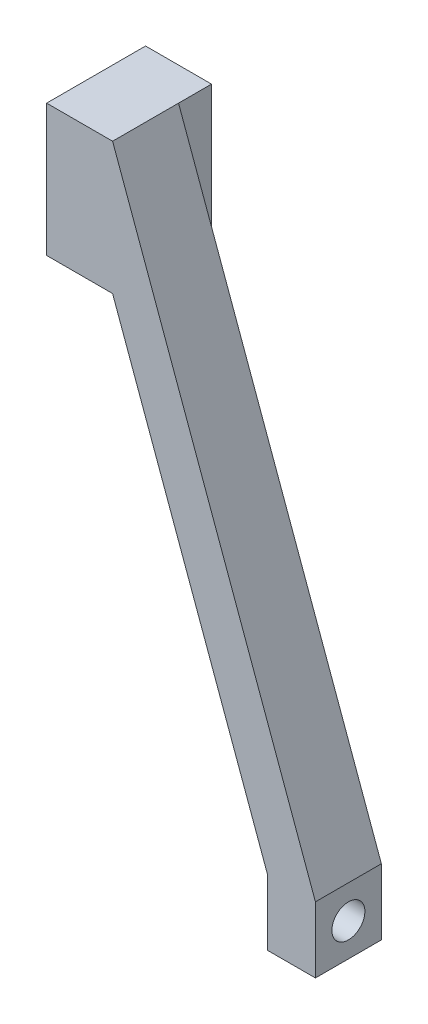
ISO-10303-21;
HEADER;
FILE_DESCRIPTION(('STEP AP214'),'2;1');
FILE_NAME('part.step','',(''),(''),'','','');
FILE_SCHEMA(('AUTOMOTIVE_DESIGN { 1 0 10303 214 1 1 1 1 }'));
ENDSEC;
DATA;
#1=APPLICATION_CONTEXT('core data for automotive mechanical design processes');
#2=APPLICATION_PROTOCOL_DEFINITION('international standard','automotive_design',2000,#1);
#3=PRODUCT_CONTEXT('',#1,'mechanical');
#4=PRODUCT('Part','Part','',(#3));
#5=PRODUCT_RELATED_PRODUCT_CATEGORY('part','',(#4));
#6=PRODUCT_DEFINITION_FORMATION('','',#4);
#7=PRODUCT_DEFINITION_CONTEXT('part definition',#1,'design');
#8=PRODUCT_DEFINITION('design','',#6,#7);
#9=PRODUCT_DEFINITION_SHAPE('','',#8);
#10=(LENGTH_UNIT() NAMED_UNIT(*) SI_UNIT(.MILLI.,.METRE.));
#11=(NAMED_UNIT(*) PLANE_ANGLE_UNIT() SI_UNIT($,.RADIAN.));
#12=(NAMED_UNIT(*) SI_UNIT($,.STERADIAN.) SOLID_ANGLE_UNIT());
#13=UNCERTAINTY_MEASURE_WITH_UNIT(LENGTH_MEASURE(1.E-05),#10,'distance_accuracy_value','');
#14=(GEOMETRIC_REPRESENTATION_CONTEXT(3) GLOBAL_UNCERTAINTY_ASSIGNED_CONTEXT((#13)) GLOBAL_UNIT_ASSIGNED_CONTEXT((#10,
#11,#12)) REPRESENTATION_CONTEXT('',''));
#15=CARTESIAN_POINT('',(0.,0.,0.));
#16=DIRECTION('',(0.,0.,1.));
#17=DIRECTION('',(1.,0.,0.));
#18=AXIS2_PLACEMENT_3D('',#15,#16,#17);
#19=CARTESIAN_POINT('',(42.5091621864025,0.,-12.7));
#20=DIRECTION('',(0.,0.,-1.));
#21=DIRECTION('',(-1.,0.,0.));
#22=AXIS2_PLACEMENT_3D('',#19,#20,#21);
#23=PLANE('',#22);
#24=DIRECTION('',(0.342020143325674,-0.939692620785907,0.));
#25=VECTOR('',#24,1.);
#26=CARTESIAN_POINT('',(12.7,0.,-12.7));
#27=LINE('',#26,#25);
#28=CARTESIAN_POINT('',(12.7,0.,-12.7));
#29=VERTEX_POINT('',#28);
#30=CARTESIAN_POINT('',(42.5091621864025,-81.9,-12.7));
#31=VERTEX_POINT('',#30);
#32=EDGE_CURVE('E130',#29,#31,#27,.T.);
#33=ORIENTED_EDGE('',*,*,#32,.F.);
#34=DIRECTION('',(0.,1.,0.));
#35=VECTOR('',#34,1.);
#36=CARTESIAN_POINT('',(12.7,0.,-12.7));
#37=LINE('',#36,#35);
#38=CARTESIAN_POINT('',(12.7,25.4,-12.7));
#39=VERTEX_POINT('',#38);
#40=EDGE_CURVE('E191',#29,#39,#37,.T.);
#41=ORIENTED_EDGE('',*,*,#40,.T.);
#42=DIRECTION('',(-0.342020143325674,0.939692620785907,0.));
#43=VECTOR('',#42,1.);
#44=CARTESIAN_POINT('',(51.7540061367641,-81.9,-12.7));
#45=LINE('',#44,#43);
#46=CARTESIAN_POINT('',(51.7540061367641,-81.9,-12.7));
#47=VERTEX_POINT('',#46);
#48=EDGE_CURVE('E125',#47,#39,#45,.T.);
#49=ORIENTED_EDGE('',*,*,#48,.F.);
#50=DIRECTION('',(0.,1.,0.));
#51=VECTOR('',#50,1.);
#52=CARTESIAN_POINT('',(51.7540061367641,-94.6,-12.7));
#53=LINE('',#52,#51);
#54=CARTESIAN_POINT('',(51.7540061367641,-94.6,-12.7));
#55=VERTEX_POINT('',#54);
#56=EDGE_CURVE('E109',#55,#47,#53,.T.);
#57=ORIENTED_EDGE('',*,*,#56,.F.);
#58=DIRECTION('',(1.,0.,0.));
#59=VECTOR('',#58,1.);
#60=CARTESIAN_POINT('',(42.5091621864025,-94.6,-12.7));
#61=LINE('',#60,#59);
#62=CARTESIAN_POINT('',(42.5091621864025,-94.6,-12.7));
#63=VERTEX_POINT('',#62);
#64=EDGE_CURVE('E123',#63,#55,#61,.T.);
#65=ORIENTED_EDGE('',*,*,#64,.F.);
#66=DIRECTION('',(0.,-1.,0.));
#67=VECTOR('',#66,1.);
#68=CARTESIAN_POINT('',(42.5091621864025,-81.9,-12.7));
#69=LINE('',#68,#67);
#70=EDGE_CURVE('E128',#31,#63,#69,.T.);
#71=ORIENTED_EDGE('',*,*,#70,.F.);
#72=EDGE_LOOP('',(#33,#41,#49,#57,#65,#71));
#73=FACE_BOUND('',#72,.T.);
#74=ADVANCED_FACE('F32',(#73),#23,.T.);
#75=CARTESIAN_POINT('',(0.,0.,-12.7));
#76=DIRECTION('',(0.,-1.,0.));
#77=DIRECTION('',(0.,0.,-1.));
#78=AXIS2_PLACEMENT_3D('',#75,#76,#77);
#79=PLANE('',#78);
#80=CARTESIAN_POINT('',(6.35,0.,-12.7));
#81=DIRECTION('',(0.,-1.,0.));
#82=DIRECTION('',(0.,0.,-1.));
#83=AXIS2_PLACEMENT_3D('',#80,#81,#82);
#84=CIRCLE('',#83,3.175);
#85=CARTESIAN_POINT('',(6.35,0.,-15.875));
#86=VERTEX_POINT('',#85);
#87=EDGE_CURVE('E342',#86,#86,#84,.T.);
#88=ORIENTED_EDGE('',*,*,#87,.F.);
#89=EDGE_LOOP('',(#88));
#90=FACE_BOUND('',#89,.T.);
#91=DIRECTION('',(1.,0.,0.));
#92=VECTOR('',#91,1.);
#93=CARTESIAN_POINT('',(0.,0.,0.));
#94=LINE('',#93,#92);
#95=CARTESIAN_POINT('',(0.,0.,0.));
#96=VERTEX_POINT('',#95);
#97=CARTESIAN_POINT('',(12.7,0.,0.));
#98=VERTEX_POINT('',#97);
#99=EDGE_CURVE('E135',#96,#98,#94,.T.);
#100=ORIENTED_EDGE('',*,*,#99,.F.);
#101=DIRECTION('',(0.,0.,1.));
#102=VECTOR('',#101,1.);
#103=CARTESIAN_POINT('',(0.,0.,-12.7));
#104=LINE('',#103,#102);
#105=CARTESIAN_POINT('',(0.,0.,-19.05));
#106=VERTEX_POINT('',#105);
#107=EDGE_CURVE('E12',#106,#96,#104,.T.);
#108=ORIENTED_EDGE('',*,*,#107,.F.);
#109=DIRECTION('',(1.,0.,0.));
#110=VECTOR('',#109,1.);
#111=CARTESIAN_POINT('',(0.,0.,-19.05));
#112=LINE('',#111,#110);
#113=CARTESIAN_POINT('',(12.7,0.,-19.05));
#114=VERTEX_POINT('',#113);
#115=EDGE_CURVE('E185',#106,#114,#112,.T.);
#116=ORIENTED_EDGE('',*,*,#115,.T.);
#117=DIRECTION('',(0.,0.,1.));
#118=VECTOR('',#117,1.);
#119=CARTESIAN_POINT('',(12.7,0.,-19.05));
#120=LINE('',#119,#118);
#121=EDGE_CURVE('E168',#114,#29,#120,.T.);
#122=ORIENTED_EDGE('',*,*,#121,.T.);
#123=DIRECTION('',(0.,0.,1.));
#124=VECTOR('',#123,1.);
#125=CARTESIAN_POINT('',(12.7,0.,-12.7));
#126=LINE('',#125,#124);
#127=EDGE_CURVE('E36',#29,#98,#126,.T.);
#128=ORIENTED_EDGE('',*,*,#127,.T.);
#129=EDGE_LOOP('',(#100,#108,#116,#122,#128));
#130=FACE_BOUND('',#129,.T.);
#131=ADVANCED_FACE('F34',(#90,#130),#79,.T.);
#132=CARTESIAN_POINT('',(0.,0.,-12.7));
#133=DIRECTION('',(-1.,0.,0.));
#134=DIRECTION('',(0.,0.,1.));
#135=AXIS2_PLACEMENT_3D('',#132,#133,#134);
#136=PLANE('',#135);
#137=DIRECTION('',(0.,-1.,0.));
#138=VECTOR('',#137,1.);
#139=CARTESIAN_POINT('',(0.,0.,0.));
#140=LINE('',#139,#138);
#141=CARTESIAN_POINT('',(0.,25.4,0.));
#142=VERTEX_POINT('',#141);
#143=EDGE_CURVE('E153',#142,#96,#140,.T.);
#144=ORIENTED_EDGE('',*,*,#143,.F.);
#145=DIRECTION('',(0.,0.,1.));
#146=VECTOR('',#145,1.);
#147=CARTESIAN_POINT('',(0.,25.4,-12.7));
#148=LINE('',#147,#146);
#149=CARTESIAN_POINT('',(0.,25.4,-19.05));
#150=VERTEX_POINT('',#149);
#151=EDGE_CURVE('E42',#150,#142,#148,.T.);
#152=ORIENTED_EDGE('',*,*,#151,.F.);
#153=DIRECTION('',(0.,-1.,0.));
#154=VECTOR('',#153,1.);
#155=CARTESIAN_POINT('',(0.,25.4,-19.05));
#156=LINE('',#155,#154);
#157=EDGE_CURVE('E176',#150,#106,#156,.T.);
#158=ORIENTED_EDGE('',*,*,#157,.T.);
#159=ORIENTED_EDGE('',*,*,#107,.T.);
#160=EDGE_LOOP('',(#144,#152,#158,#159));
#161=FACE_BOUND('',#160,.T.);
#162=ADVANCED_FACE('F172',(#161),#136,.T.);
#163=CARTESIAN_POINT('',(0.,25.4,-12.7));
#164=DIRECTION('',(0.,1.,0.));
#165=DIRECTION('',(0.,0.,1.));
#166=AXIS2_PLACEMENT_3D('',#163,#164,#165);
#167=PLANE('',#166);
#168=DIRECTION('',(-1.,0.,0.));
#169=VECTOR('',#168,1.);
#170=CARTESIAN_POINT('',(0.,25.4,0.));
#171=LINE('',#170,#169);
#172=CARTESIAN_POINT('',(12.7,25.4,0.));
#173=VERTEX_POINT('',#172);
#174=EDGE_CURVE('E151',#173,#142,#171,.T.);
#175=ORIENTED_EDGE('',*,*,#174,.F.);
#176=DIRECTION('',(0.,0.,1.));
#177=VECTOR('',#176,1.);
#178=CARTESIAN_POINT('',(12.7,25.4,-12.7));
#179=LINE('',#178,#177);
#180=EDGE_CURVE('E157',#39,#173,#179,.T.);
#181=ORIENTED_EDGE('',*,*,#180,.F.);
#182=DIRECTION('',(0.,0.,1.));
#183=VECTOR('',#182,1.);
#184=CARTESIAN_POINT('',(12.7,25.4,-19.05));
#185=LINE('',#184,#183);
#186=CARTESIAN_POINT('',(12.7,25.4,-19.05));
#187=VERTEX_POINT('',#186);
#188=EDGE_CURVE('E51',#187,#39,#185,.T.);
#189=ORIENTED_EDGE('',*,*,#188,.F.);
#190=DIRECTION('',(-1.,0.,0.));
#191=VECTOR('',#190,1.);
#192=CARTESIAN_POINT('',(12.7,25.4,-19.05));
#193=LINE('',#192,#191);
#194=EDGE_CURVE('E184',#187,#150,#193,.T.);
#195=ORIENTED_EDGE('',*,*,#194,.T.);
#196=ORIENTED_EDGE('',*,*,#151,.T.);
#197=EDGE_LOOP('',(#175,#181,#189,#195,#196));
#198=FACE_BOUND('',#197,.T.);
#199=ADVANCED_FACE('F187',(#198),#167,.T.);
#200=CARTESIAN_POINT('',(51.7540061367641,-81.9,-12.7));
#201=DIRECTION('',(0.939692620785907,0.342020143325674,0.));
#202=DIRECTION('',(-0.342020143325674,0.939692620785907,0.));
#203=AXIS2_PLACEMENT_3D('',#200,#201,#202);
#204=PLANE('',#203);
#205=DIRECTION('',(-0.342020143325674,0.939692620785907,0.));
#206=VECTOR('',#205,1.);
#207=CARTESIAN_POINT('',(51.7540061367641,-81.9,0.));
#208=LINE('',#207,#206);
#209=CARTESIAN_POINT('',(51.7540061367641,-81.9,0.));
#210=VERTEX_POINT('',#209);
#211=EDGE_CURVE('E148',#210,#173,#208,.T.);
#212=ORIENTED_EDGE('',*,*,#211,.F.);
#213=DIRECTION('',(0.,0.,1.));
#214=VECTOR('',#213,1.);
#215=CARTESIAN_POINT('',(51.7540061367641,-81.9,-12.7));
#216=LINE('',#215,#214);
#217=EDGE_CURVE('E116',#47,#210,#216,.T.);
#218=ORIENTED_EDGE('',*,*,#217,.F.);
#219=ORIENTED_EDGE('',*,*,#48,.T.);
#220=ORIENTED_EDGE('',*,*,#180,.T.);
#221=EDGE_LOOP('',(#212,#218,#219,#220));
#222=FACE_BOUND('',#221,.T.);
#223=ADVANCED_FACE('F231',(#222),#204,.T.);
#224=CARTESIAN_POINT('',(51.7540061367641,-94.6,-12.7));
#225=DIRECTION('',(1.,0.,0.));
#226=DIRECTION('',(0.,0.,-1.));
#227=AXIS2_PLACEMENT_3D('',#224,#225,#226);
#228=PLANE('',#227);
#229=CARTESIAN_POINT('',(51.7540061367641,-88.25,-6.35));
#230=DIRECTION('',(-1.,0.,0.));
#231=DIRECTION('',(0.,0.,1.));
#232=AXIS2_PLACEMENT_3D('',#229,#230,#231);
#233=CIRCLE('',#232,3.175);
#234=CARTESIAN_POINT('',(51.7540061367641,-88.25,-3.175));
#235=VERTEX_POINT('',#234);
#236=EDGE_CURVE('E139',#235,#235,#233,.T.);
#237=ORIENTED_EDGE('',*,*,#236,.T.);
#238=EDGE_LOOP('',(#237));
#239=FACE_BOUND('',#238,.T.);
#240=DIRECTION('',(0.,1.,0.));
#241=VECTOR('',#240,1.);
#242=CARTESIAN_POINT('',(51.7540061367641,-94.6,0.));
#243=LINE('',#242,#241);
#244=CARTESIAN_POINT('',(51.7540061367641,-94.6,0.));
#245=VERTEX_POINT('',#244);
#246=EDGE_CURVE('E111',#245,#210,#243,.T.);
#247=ORIENTED_EDGE('',*,*,#246,.F.);
#248=DIRECTION('',(0.,0.,1.));
#249=VECTOR('',#248,1.);
#250=CARTESIAN_POINT('',(51.7540061367641,-94.6,-12.7));
#251=LINE('',#250,#249);
#252=EDGE_CURVE('E106',#55,#245,#251,.T.);
#253=ORIENTED_EDGE('',*,*,#252,.F.);
#254=ORIENTED_EDGE('',*,*,#56,.T.);
#255=ORIENTED_EDGE('',*,*,#217,.T.);
#256=EDGE_LOOP('',(#247,#253,#254,#255));
#257=FACE_BOUND('',#256,.T.);
#258=ADVANCED_FACE('F108',(#239,#257),#228,.T.);
#259=CARTESIAN_POINT('',(42.5091621864025,-94.6,-12.7));
#260=DIRECTION('',(0.,-1.,0.));
#261=DIRECTION('',(0.,0.,-1.));
#262=AXIS2_PLACEMENT_3D('',#259,#260,#261);
#263=PLANE('',#262);
#264=DIRECTION('',(1.,0.,0.));
#265=VECTOR('',#264,1.);
#266=CARTESIAN_POINT('',(42.5091621864025,-94.6,0.));
#267=LINE('',#266,#265);
#268=CARTESIAN_POINT('',(42.5091621864025,-94.6,0.));
#269=VERTEX_POINT('',#268);
#270=EDGE_CURVE('E145',#269,#245,#267,.T.);
#271=ORIENTED_EDGE('',*,*,#270,.F.);
#272=DIRECTION('',(0.,0.,1.));
#273=VECTOR('',#272,1.);
#274=CARTESIAN_POINT('',(42.5091621864025,-94.6,-12.7));
#275=LINE('',#274,#273);
#276=EDGE_CURVE('E117',#63,#269,#275,.T.);
#277=ORIENTED_EDGE('',*,*,#276,.F.);
#278=ORIENTED_EDGE('',*,*,#64,.T.);
#279=ORIENTED_EDGE('',*,*,#252,.T.);
#280=EDGE_LOOP('',(#271,#277,#278,#279));
#281=FACE_BOUND('',#280,.T.);
#282=ADVANCED_FACE('F127',(#281),#263,.T.);
#283=CARTESIAN_POINT('',(42.5091621864025,-81.9,-12.7));
#284=DIRECTION('',(-1.,0.,0.));
#285=DIRECTION('',(0.,0.,1.));
#286=AXIS2_PLACEMENT_3D('',#283,#284,#285);
#287=PLANE('',#286);
#288=CARTESIAN_POINT('',(42.5091621864025,-88.25,-6.35));
#289=DIRECTION('',(-1.,0.,0.));
#290=DIRECTION('',(0.,0.,1.));
#291=AXIS2_PLACEMENT_3D('',#288,#289,#290);
#292=CIRCLE('',#291,3.175);
#293=CARTESIAN_POINT('',(42.5091621864025,-88.25,-3.175));
#294=VERTEX_POINT('',#293);
#295=EDGE_CURVE('E199',#294,#294,#292,.T.);
#296=ORIENTED_EDGE('',*,*,#295,.F.);
#297=EDGE_LOOP('',(#296));
#298=FACE_BOUND('',#297,.T.);
#299=DIRECTION('',(0.,-1.,0.));
#300=VECTOR('',#299,1.);
#301=CARTESIAN_POINT('',(42.5091621864025,-81.9,0.));
#302=LINE('',#301,#300);
#303=CARTESIAN_POINT('',(42.5091621864025,-81.9,0.));
#304=VERTEX_POINT('',#303);
#305=EDGE_CURVE('E142',#304,#269,#302,.T.);
#306=ORIENTED_EDGE('',*,*,#305,.F.);
#307=DIRECTION('',(0.,0.,1.));
#308=VECTOR('',#307,1.);
#309=CARTESIAN_POINT('',(42.5091621864025,-81.9,-12.7));
#310=LINE('',#309,#308);
#311=EDGE_CURVE('E95',#31,#304,#310,.T.);
#312=ORIENTED_EDGE('',*,*,#311,.F.);
#313=ORIENTED_EDGE('',*,*,#70,.T.);
#314=ORIENTED_EDGE('',*,*,#276,.T.);
#315=EDGE_LOOP('',(#306,#312,#313,#314));
#316=FACE_BOUND('',#315,.T.);
#317=ADVANCED_FACE('F240',(#298,#316),#287,.T.);
#318=CARTESIAN_POINT('',(12.7,0.,-12.7));
#319=DIRECTION('',(-0.939692620785906,-0.342020143325674,0.));
#320=DIRECTION('',(0.342020143325674,-0.939692620785907,0.));
#321=AXIS2_PLACEMENT_3D('',#318,#319,#320);
#322=PLANE('',#321);
#323=DIRECTION('',(0.342020143325674,-0.939692620785907,0.));
#324=VECTOR('',#323,1.);
#325=CARTESIAN_POINT('',(12.7,0.,0.));
#326=LINE('',#325,#324);
#327=EDGE_CURVE('E138',#98,#304,#326,.T.);
#328=ORIENTED_EDGE('',*,*,#327,.F.);
#329=ORIENTED_EDGE('',*,*,#127,.F.);
#330=ORIENTED_EDGE('',*,*,#32,.T.);
#331=ORIENTED_EDGE('',*,*,#311,.T.);
#332=EDGE_LOOP('',(#328,#329,#330,#331));
#333=FACE_BOUND('',#332,.T.);
#334=ADVANCED_FACE('F169',(#333),#322,.T.);
#335=CARTESIAN_POINT('',(42.5091621864025,0.,0.));
#336=DIRECTION('',(0.,0.,-1.));
#337=DIRECTION('',(-1.,0.,0.));
#338=AXIS2_PLACEMENT_3D('',#335,#336,#337);
#339=PLANE('',#338);
#340=ORIENTED_EDGE('',*,*,#99,.T.);
#341=ORIENTED_EDGE('',*,*,#327,.T.);
#342=ORIENTED_EDGE('',*,*,#305,.T.);
#343=ORIENTED_EDGE('',*,*,#270,.T.);
#344=ORIENTED_EDGE('',*,*,#246,.T.);
#345=ORIENTED_EDGE('',*,*,#211,.T.);
#346=ORIENTED_EDGE('',*,*,#174,.T.);
#347=ORIENTED_EDGE('',*,*,#143,.T.);
#348=EDGE_LOOP('',(#340,#341,#342,#343,#344,#345,#346,#347));
#349=FACE_BOUND('',#348,.T.);
#350=ADVANCED_FACE('F171',(#349),#339,.F.);
#351=CARTESIAN_POINT('',(51.7540061367641,-88.25,-6.35));
#352=DIRECTION('',(-1.,0.,0.));
#353=DIRECTION('',(0.,0.,1.));
#354=AXIS2_PLACEMENT_3D('',#351,#352,#353);
#355=CYLINDRICAL_SURFACE('',#354,3.175);
#356=ORIENTED_EDGE('',*,*,#236,.F.);
#357=EDGE_LOOP('',(#356));
#358=FACE_BOUND('',#357,.T.);
#359=ORIENTED_EDGE('',*,*,#295,.T.);
#360=EDGE_LOOP('',(#359));
#361=FACE_BOUND('',#360,.T.);
#362=ADVANCED_FACE('F208',(#358,#361),#355,.F.);
#363=CARTESIAN_POINT('',(12.7,0.,-19.05));
#364=DIRECTION('',(1.,0.,0.));
#365=DIRECTION('',(0.,1.,0.));
#366=AXIS2_PLACEMENT_3D('',#363,#364,#365);
#367=PLANE('',#366);
#368=ORIENTED_EDGE('',*,*,#40,.F.);
#369=ORIENTED_EDGE('',*,*,#121,.F.);
#370=DIRECTION('',(0.,1.,0.));
#371=VECTOR('',#370,1.);
#372=CARTESIAN_POINT('',(12.7,0.,-19.05));
#373=LINE('',#372,#371);
#374=EDGE_CURVE('E189',#114,#187,#373,.T.);
#375=ORIENTED_EDGE('',*,*,#374,.T.);
#376=ORIENTED_EDGE('',*,*,#188,.T.);
#377=EDGE_LOOP('',(#368,#369,#375,#376));
#378=FACE_BOUND('',#377,.T.);
#379=ADVANCED_FACE('F206',(#378),#367,.T.);
#380=CARTESIAN_POINT('',(12.7,25.4,-19.05));
#381=DIRECTION('',(0.,0.,1.));
#382=DIRECTION('',(1.,0.,0.));
#383=AXIS2_PLACEMENT_3D('',#380,#381,#382);
#384=PLANE('',#383);
#385=ORIENTED_EDGE('',*,*,#374,.F.);
#386=ORIENTED_EDGE('',*,*,#115,.F.);
#387=ORIENTED_EDGE('',*,*,#157,.F.);
#388=ORIENTED_EDGE('',*,*,#194,.F.);
#389=EDGE_LOOP('',(#385,#386,#387,#388));
#390=FACE_BOUND('',#389,.T.);
#391=ADVANCED_FACE('F183',(#390),#384,.F.);
#392=CARTESIAN_POINT('',(6.35,19.05,-12.7));
#393=DIRECTION('',(0.,-1.,0.));
#394=DIRECTION('',(0.,0.,-1.));
#395=AXIS2_PLACEMENT_3D('',#392,#393,#394);
#396=CYLINDRICAL_SURFACE('',#395,3.175);
#397=CARTESIAN_POINT('',(6.35,19.05,-12.7));
#398=DIRECTION('',(0.,-1.,0.));
#399=DIRECTION('',(0.,0.,-1.));
#400=AXIS2_PLACEMENT_3D('',#397,#398,#399);
#401=CIRCLE('',#400,3.175);
#402=CARTESIAN_POINT('',(6.35,19.05,-15.875));
#403=VERTEX_POINT('',#402);
#404=EDGE_CURVE('E197',#403,#403,#401,.T.);
#405=ORIENTED_EDGE('',*,*,#404,.F.);
#406=EDGE_LOOP('',(#405));
#407=FACE_BOUND('',#406,.T.);
#408=ORIENTED_EDGE('',*,*,#87,.T.);
#409=EDGE_LOOP('',(#408));
#410=FACE_BOUND('',#409,.T.);
#411=ADVANCED_FACE('F214',(#407,#410),#396,.F.);
#412=CARTESIAN_POINT('',(6.35,19.05,-12.7));
#413=DIRECTION('',(0.,-1.,0.));
#414=DIRECTION('',(0.,0.,-1.));
#415=AXIS2_PLACEMENT_3D('',#412,#413,#414);
#416=PLANE('',#415);
#417=ORIENTED_EDGE('',*,*,#404,.T.);
#418=EDGE_LOOP('',(#417));
#419=FACE_BOUND('',#418,.T.);
#420=ADVANCED_FACE('F326',(#419),#416,.T.);
#421=CLOSED_SHELL('',(#74,#131,#162,#199,#223,#258,#282,#317,#334,#350,#362,#379,#391,#411,#420));
#422=MANIFOLD_SOLID_BREP('B2',#421);
#423=ADVANCED_BREP_SHAPE_REPRESENTATION('',(#18,#422),#14);
#424=SHAPE_DEFINITION_REPRESENTATION(#9,#423);
ENDSEC;
END-ISO-10303-21;
